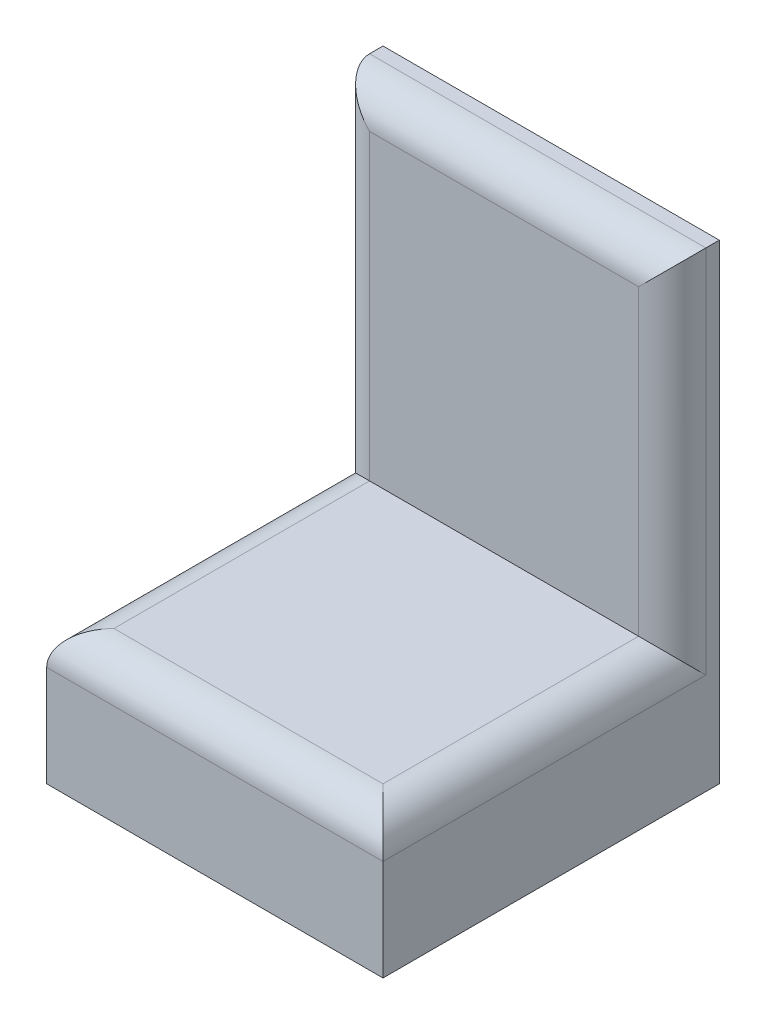
ISO-10303-21;
HEADER;
FILE_DESCRIPTION(('STEP AP214'),'2;1');
FILE_NAME('part.step','',(''),(''),'','','');
FILE_SCHEMA(('AUTOMOTIVE_DESIGN { 1 0 10303 214 1 1 1 1 }'));
ENDSEC;
DATA;
#1=APPLICATION_CONTEXT('core data for automotive mechanical design processes');
#2=APPLICATION_PROTOCOL_DEFINITION('international standard','automotive_design',2000,#1);
#3=PRODUCT_CONTEXT('',#1,'mechanical');
#4=PRODUCT('Part','Part','',(#3));
#5=PRODUCT_RELATED_PRODUCT_CATEGORY('part','',(#4));
#6=PRODUCT_DEFINITION_FORMATION('','',#4);
#7=PRODUCT_DEFINITION_CONTEXT('part definition',#1,'design');
#8=PRODUCT_DEFINITION('design','',#6,#7);
#9=PRODUCT_DEFINITION_SHAPE('','',#8);
#10=(LENGTH_UNIT() NAMED_UNIT(*) SI_UNIT(.MILLI.,.METRE.));
#11=(NAMED_UNIT(*) PLANE_ANGLE_UNIT() SI_UNIT($,.RADIAN.));
#12=(NAMED_UNIT(*) SI_UNIT($,.STERADIAN.) SOLID_ANGLE_UNIT());
#13=UNCERTAINTY_MEASURE_WITH_UNIT(LENGTH_MEASURE(1.E-05),#10,'distance_accuracy_value','');
#14=(GEOMETRIC_REPRESENTATION_CONTEXT(3) GLOBAL_UNCERTAINTY_ASSIGNED_CONTEXT((#13)) GLOBAL_UNIT_ASSIGNED_CONTEXT((#10,
#11,#12)) REPRESENTATION_CONTEXT('',''));
#15=CARTESIAN_POINT('',(0.,0.,0.));
#16=DIRECTION('',(0.,0.,1.));
#17=DIRECTION('',(1.,0.,0.));
#18=AXIS2_PLACEMENT_3D('',#15,#16,#17);
#19=CARTESIAN_POINT('',(500.,41.2352941176501,0.));
#20=DIRECTION('',(0.,0.,1.));
#21=DIRECTION('',(1.,0.,0.));
#22=AXIS2_PLACEMENT_3D('',#19,#20,#21);
#23=PLANE('',#22);
#24=DIRECTION('',(0.,1.,0.));
#25=VECTOR('',#24,1.);
#26=CARTESIAN_POINT('',(0.,41.2352941176501,0.));
#27=LINE('',#26,#25);
#28=CARTESIAN_POINT('',(0.,0.,0.));
#29=VERTEX_POINT('',#28);
#30=CARTESIAN_POINT('',(0.,700.,0.));
#31=VERTEX_POINT('',#30);
#32=EDGE_CURVE('E194',#29,#31,#27,.T.);
#33=ORIENTED_EDGE('',*,*,#32,.T.);
#34=DIRECTION('',(-1.,0.,0.));
#35=VECTOR('',#34,1.);
#36=CARTESIAN_POINT('',(500.,700.,0.));
#37=LINE('',#36,#35);
#38=CARTESIAN_POINT('',(500.,700.,0.));
#39=VERTEX_POINT('',#38);
#40=EDGE_CURVE('E193',#39,#31,#37,.T.);
#41=ORIENTED_EDGE('',*,*,#40,.F.);
#42=DIRECTION('',(0.,1.,0.));
#43=VECTOR('',#42,1.);
#44=CARTESIAN_POINT('',(500.,0.,0.));
#45=LINE('',#44,#43);
#46=CARTESIAN_POINT('',(500.,0.,0.));
#47=VERTEX_POINT('',#46);
#48=EDGE_CURVE('E179',#47,#39,#45,.T.);
#49=ORIENTED_EDGE('',*,*,#48,.F.);
#50=DIRECTION('',(-1.,0.,0.));
#51=VECTOR('',#50,1.);
#52=CARTESIAN_POINT('',(500.,0.,0.));
#53=LINE('',#52,#51);
#54=EDGE_CURVE('E214',#47,#29,#53,.T.);
#55=ORIENTED_EDGE('',*,*,#54,.T.);
#56=EDGE_LOOP('',(#33,#41,#49,#55));
#57=FACE_BOUND('',#56,.T.);
#58=ADVANCED_FACE('F41',(#57),#23,.F.);
#59=CARTESIAN_POINT('',(500.,700.,70.));
#60=DIRECTION('',(0.,-1.,0.));
#61=DIRECTION('',(0.,0.,-1.));
#62=AXIS2_PLACEMENT_3D('',#59,#60,#61);
#63=PLANE('',#62);
#64=DIRECTION('',(0.,0.,1.));
#65=VECTOR('',#64,1.);
#66=CARTESIAN_POINT('',(0.,700.,70.));
#67=LINE('',#66,#65);
#68=CARTESIAN_POINT('',(0.,700.,20.));
#69=VERTEX_POINT('',#68);
#70=EDGE_CURVE('E217',#31,#69,#67,.T.);
#71=ORIENTED_EDGE('',*,*,#70,.T.);
#72=DIRECTION('',(-1.,0.,0.));
#73=VECTOR('',#72,1.);
#74=CARTESIAN_POINT('',(500.,700.,20.));
#75=LINE('',#74,#73);
#76=CARTESIAN_POINT('',(500.,700.,20.));
#77=VERTEX_POINT('',#76);
#78=EDGE_CURVE('E205',#69,#77,#75,.F.);
#79=ORIENTED_EDGE('',*,*,#78,.T.);
#80=DIRECTION('',(0.,0.,1.));
#81=VECTOR('',#80,1.);
#82=CARTESIAN_POINT('',(500.,700.,70.));
#83=LINE('',#82,#81);
#84=EDGE_CURVE('E183',#39,#77,#83,.T.);
#85=ORIENTED_EDGE('',*,*,#84,.F.);
#86=ORIENTED_EDGE('',*,*,#40,.T.);
#87=EDGE_LOOP('',(#71,#79,#85,#86));
#88=FACE_BOUND('',#87,.T.);
#89=ADVANCED_FACE('F203',(#88),#63,.F.);
#90=CARTESIAN_POINT('',(500.,200.,70.));
#91=DIRECTION('',(0.,0.,-1.));
#92=DIRECTION('',(0.,1.,0.));
#93=AXIS2_PLACEMENT_3D('',#90,#91,#92);
#94=PLANE('',#93);
#95=DIRECTION('',(-1.,0.,0.));
#96=VECTOR('',#95,1.);
#97=CARTESIAN_POINT('',(500.,650.,70.));
#98=LINE('',#97,#96);
#99=CARTESIAN_POINT('',(450.,650.,70.));
#100=VERTEX_POINT('',#99);
#101=CARTESIAN_POINT('',(50.,650.,70.));
#102=VERTEX_POINT('',#101);
#103=EDGE_CURVE('E237',#100,#102,#98,.T.);
#104=ORIENTED_EDGE('',*,*,#103,.T.);
#105=DIRECTION('',(0.,-1.,0.));
#106=VECTOR('',#105,1.);
#107=CARTESIAN_POINT('',(50.,200.,70.));
#108=LINE('',#107,#106);
#109=CARTESIAN_POINT('',(50.,200.,70.));
#110=VERTEX_POINT('',#109);
#111=EDGE_CURVE('E241',#102,#110,#108,.T.);
#112=ORIENTED_EDGE('',*,*,#111,.T.);
#113=DIRECTION('',(-1.,0.,0.));
#114=VECTOR('',#113,1.);
#115=CARTESIAN_POINT('',(500.,200.,70.));
#116=LINE('',#115,#114);
#117=CARTESIAN_POINT('',(450.,200.,70.));
#118=VERTEX_POINT('',#117);
#119=EDGE_CURVE('E200',#118,#110,#116,.T.);
#120=ORIENTED_EDGE('',*,*,#119,.F.);
#121=DIRECTION('',(0.,-1.,0.));
#122=VECTOR('',#121,1.);
#123=CARTESIAN_POINT('',(450.,200.,70.));
#124=LINE('',#123,#122);
#125=EDGE_CURVE('E199',#118,#100,#124,.F.);
#126=ORIENTED_EDGE('',*,*,#125,.T.);
#127=EDGE_LOOP('',(#104,#112,#120,#126));
#128=FACE_BOUND('',#127,.T.);
#129=ADVANCED_FACE('F613',(#128),#94,.F.);
#130=CARTESIAN_POINT('',(500.,200.,70.));
#131=DIRECTION('',(0.,-1.,0.));
#132=DIRECTION('',(0.,0.,-1.));
#133=AXIS2_PLACEMENT_3D('',#130,#131,#132);
#134=PLANE('',#133);
#135=ORIENTED_EDGE('',*,*,#119,.T.);
#136=DIRECTION('',(0.,0.,1.));
#137=VECTOR('',#136,1.);
#138=CARTESIAN_POINT('',(50.,200.,500.));
#139=LINE('',#138,#137);
#140=CARTESIAN_POINT('',(50.,200.,450.));
#141=VERTEX_POINT('',#140);
#142=EDGE_CURVE('E124',#110,#141,#139,.T.);
#143=ORIENTED_EDGE('',*,*,#142,.T.);
#144=DIRECTION('',(-1.,0.,0.));
#145=VECTOR('',#144,1.);
#146=CARTESIAN_POINT('',(500.,200.,450.));
#147=LINE('',#146,#145);
#148=CARTESIAN_POINT('',(450.,200.,450.));
#149=VERTEX_POINT('',#148);
#150=EDGE_CURVE('E128',#141,#149,#147,.F.);
#151=ORIENTED_EDGE('',*,*,#150,.T.);
#152=DIRECTION('',(0.,0.,1.));
#153=VECTOR('',#152,1.);
#154=CARTESIAN_POINT('',(450.,200.,70.));
#155=LINE('',#154,#153);
#156=EDGE_CURVE('E258',#149,#118,#155,.F.);
#157=ORIENTED_EDGE('',*,*,#156,.T.);
#158=EDGE_LOOP('',(#135,#143,#151,#157));
#159=FACE_BOUND('',#158,.T.);
#160=ADVANCED_FACE('F603',(#159),#134,.F.);
#161=CARTESIAN_POINT('',(500.,0.,500.));
#162=DIRECTION('',(0.,0.,-1.));
#163=DIRECTION('',(-1.,0.,0.));
#164=AXIS2_PLACEMENT_3D('',#161,#162,#163);
#165=PLANE('',#164);
#166=DIRECTION('',(0.,-1.,0.));
#167=VECTOR('',#166,1.);
#168=CARTESIAN_POINT('',(500.,0.,500.));
#169=LINE('',#168,#167);
#170=CARTESIAN_POINT('',(500.,150.,500.));
#171=VERTEX_POINT('',#170);
#172=CARTESIAN_POINT('',(500.,0.,500.));
#173=VERTEX_POINT('',#172);
#174=EDGE_CURVE('E207',#171,#173,#169,.T.);
#175=ORIENTED_EDGE('',*,*,#174,.F.);
#176=DIRECTION('',(-1.,0.,0.));
#177=VECTOR('',#176,1.);
#178=CARTESIAN_POINT('',(500.,150.,500.));
#179=LINE('',#178,#177);
#180=CARTESIAN_POINT('',(0.,150.,500.));
#181=VERTEX_POINT('',#180);
#182=EDGE_CURVE('E265',#171,#181,#179,.T.);
#183=ORIENTED_EDGE('',*,*,#182,.T.);
#184=DIRECTION('',(0.,-1.,0.));
#185=VECTOR('',#184,1.);
#186=CARTESIAN_POINT('',(0.,0.,500.));
#187=LINE('',#186,#185);
#188=CARTESIAN_POINT('',(0.,0.,500.));
#189=VERTEX_POINT('',#188);
#190=EDGE_CURVE('E221',#181,#189,#187,.T.);
#191=ORIENTED_EDGE('',*,*,#190,.T.);
#192=DIRECTION('',(-1.,0.,0.));
#193=VECTOR('',#192,1.);
#194=CARTESIAN_POINT('',(500.,0.,500.));
#195=LINE('',#194,#193);
#196=EDGE_CURVE('E229',#173,#189,#195,.T.);
#197=ORIENTED_EDGE('',*,*,#196,.F.);
#198=EDGE_LOOP('',(#175,#183,#191,#197));
#199=FACE_BOUND('',#198,.T.);
#200=ADVANCED_FACE('F598',(#199),#165,.F.);
#201=CARTESIAN_POINT('',(500.,0.,0.));
#202=DIRECTION('',(0.,1.,0.));
#203=DIRECTION('',(0.,0.,1.));
#204=AXIS2_PLACEMENT_3D('',#201,#202,#203);
#205=PLANE('',#204);
#206=DIRECTION('',(0.,0.,-1.));
#207=VECTOR('',#206,1.);
#208=CARTESIAN_POINT('',(0.,0.,0.));
#209=LINE('',#208,#207);
#210=EDGE_CURVE('E190',#189,#29,#209,.T.);
#211=ORIENTED_EDGE('',*,*,#210,.T.);
#212=ORIENTED_EDGE('',*,*,#54,.F.);
#213=DIRECTION('',(0.,0.,-1.));
#214=VECTOR('',#213,1.);
#215=CARTESIAN_POINT('',(500.,0.,0.));
#216=LINE('',#215,#214);
#217=EDGE_CURVE('E185',#173,#47,#216,.T.);
#218=ORIENTED_EDGE('',*,*,#217,.F.);
#219=ORIENTED_EDGE('',*,*,#196,.T.);
#220=EDGE_LOOP('',(#211,#212,#218,#219));
#221=FACE_BOUND('',#220,.T.);
#222=ADVANCED_FACE('F591',(#221),#205,.F.);
#223=CARTESIAN_POINT('',(500.,0.,0.));
#224=DIRECTION('',(-1.,0.,0.));
#225=DIRECTION('',(0.,0.,1.));
#226=AXIS2_PLACEMENT_3D('',#223,#224,#225);
#227=PLANE('',#226);
#228=ORIENTED_EDGE('',*,*,#84,.T.);
#229=DIRECTION('',(0.,-1.,0.));
#230=VECTOR('',#229,1.);
#231=CARTESIAN_POINT('',(500.,0.,20.));
#232=LINE('',#231,#230);
#233=CARTESIAN_POINT('',(500.,150.,20.));
#234=VERTEX_POINT('',#233);
#235=EDGE_CURVE('E255',#77,#234,#232,.T.);
#236=ORIENTED_EDGE('',*,*,#235,.T.);
#237=DIRECTION('',(0.,0.,1.));
#238=VECTOR('',#237,1.);
#239=CARTESIAN_POINT('',(500.,150.,0.));
#240=LINE('',#239,#238);
#241=EDGE_CURVE('E252',#234,#171,#240,.T.);
#242=ORIENTED_EDGE('',*,*,#241,.T.);
#243=ORIENTED_EDGE('',*,*,#174,.T.);
#244=ORIENTED_EDGE('',*,*,#217,.T.);
#245=ORIENTED_EDGE('',*,*,#48,.T.);
#246=EDGE_LOOP('',(#228,#236,#242,#243,#244,#245));
#247=FACE_BOUND('',#246,.T.);
#248=ADVANCED_FACE('F181',(#247),#227,.F.);
#249=CARTESIAN_POINT('',(0.,0.,0.));
#250=DIRECTION('',(-1.,0.,0.));
#251=DIRECTION('',(0.,0.,1.));
#252=AXIS2_PLACEMENT_3D('',#249,#250,#251);
#253=PLANE('',#252);
#254=DIRECTION('',(0.,0.,1.));
#255=VECTOR('',#254,1.);
#256=CARTESIAN_POINT('',(0.,150.,70.));
#257=LINE('',#256,#255);
#258=CARTESIAN_POINT('',(0.,150.,20.));
#259=VERTEX_POINT('',#258);
#260=EDGE_CURVE('E246',#181,#259,#257,.F.);
#261=ORIENTED_EDGE('',*,*,#260,.T.);
#262=DIRECTION('',(0.,-1.,0.));
#263=VECTOR('',#262,1.);
#264=CARTESIAN_POINT('',(0.,700.,20.));
#265=LINE('',#264,#263);
#266=EDGE_CURVE('E249',#259,#69,#265,.F.);
#267=ORIENTED_EDGE('',*,*,#266,.T.);
#268=ORIENTED_EDGE('',*,*,#70,.F.);
#269=ORIENTED_EDGE('',*,*,#32,.F.);
#270=ORIENTED_EDGE('',*,*,#210,.F.);
#271=ORIENTED_EDGE('',*,*,#190,.F.);
#272=EDGE_LOOP('',(#261,#267,#268,#269,#270,#271));
#273=FACE_BOUND('',#272,.T.);
#274=ADVANCED_FACE('F573',(#273),#253,.T.);
#275=CARTESIAN_POINT('',(500.,150.,450.));
#276=DIRECTION('',(-1.,0.,0.));
#277=DIRECTION('',(0.,0.,1.));
#278=AXIS2_PLACEMENT_3D('',#275,#276,#277);
#279=CYLINDRICAL_SURFACE('',#278,50.);
#280=CARTESIAN_POINT('',(50.,150.,450.));
#281=DIRECTION('',(-0.707106781186547,0.,-0.707106781186547));
#282=DIRECTION('',(-0.707106781186547,0.,0.707106781186547));
#283=AXIS2_PLACEMENT_3D('',#280,#281,#282);
#284=ELLIPSE('',#283,70.7106781186548,50.);
#285=EDGE_CURVE('E282',#181,#141,#284,.T.);
#286=ORIENTED_EDGE('',*,*,#285,.F.);
#287=ORIENTED_EDGE('',*,*,#182,.F.);
#288=CARTESIAN_POINT('',(450.,150.,450.));
#289=DIRECTION('',(-0.707106781186547,0.,0.707106781186547));
#290=DIRECTION('',(0.707106781186547,0.,0.707106781186547));
#291=AXIS2_PLACEMENT_3D('',#288,#289,#290);
#292=ELLIPSE('',#291,70.7106781186548,50.);
#293=EDGE_CURVE('E218',#149,#171,#292,.F.);
#294=ORIENTED_EDGE('',*,*,#293,.F.);
#295=ORIENTED_EDGE('',*,*,#150,.F.);
#296=EDGE_LOOP('',(#286,#287,#294,#295));
#297=FACE_BOUND('',#296,.T.);
#298=ADVANCED_FACE('F424',(#297),#279,.T.);
#299=CARTESIAN_POINT('',(450.,150.,0.));
#300=DIRECTION('',(0.,0.,1.));
#301=DIRECTION('',(0.,-1.,0.));
#302=AXIS2_PLACEMENT_3D('',#299,#300,#301);
#303=CYLINDRICAL_SURFACE('',#302,50.);
#304=ORIENTED_EDGE('',*,*,#293,.T.);
#305=ORIENTED_EDGE('',*,*,#241,.F.);
#306=CARTESIAN_POINT('',(450.,150.,20.));
#307=DIRECTION('',(0.,-0.707106781186548,0.707106781186547));
#308=DIRECTION('',(0.,-0.707106781186547,-0.707106781186548));
#309=AXIS2_PLACEMENT_3D('',#306,#307,#308);
#310=ELLIPSE('',#309,70.7106781186548,50.);
#311=EDGE_CURVE('E278',#118,#234,#310,.F.);
#312=ORIENTED_EDGE('',*,*,#311,.F.);
#313=ORIENTED_EDGE('',*,*,#156,.F.);
#314=EDGE_LOOP('',(#304,#305,#312,#313));
#315=FACE_BOUND('',#314,.T.);
#316=ADVANCED_FACE('F555',(#315),#303,.T.);
#317=CARTESIAN_POINT('',(50.,150.,70.));
#318=DIRECTION('',(0.,0.,-1.));
#319=DIRECTION('',(0.,1.,0.));
#320=AXIS2_PLACEMENT_3D('',#317,#318,#319);
#321=CYLINDRICAL_SURFACE('',#320,50.);
#322=ORIENTED_EDGE('',*,*,#285,.T.);
#323=ORIENTED_EDGE('',*,*,#142,.F.);
#324=CARTESIAN_POINT('',(50.,150.,20.));
#325=DIRECTION('',(0.,0.707106781186548,-0.707106781186547));
#326=DIRECTION('',(0.,0.707106781186547,0.707106781186548));
#327=AXIS2_PLACEMENT_3D('',#324,#325,#326);
#328=ELLIPSE('',#327,70.7106781186548,50.);
#329=EDGE_CURVE('E274',#259,#110,#328,.T.);
#330=ORIENTED_EDGE('',*,*,#329,.F.);
#331=ORIENTED_EDGE('',*,*,#260,.F.);
#332=EDGE_LOOP('',(#322,#323,#330,#331));
#333=FACE_BOUND('',#332,.T.);
#334=ADVANCED_FACE('F545',(#333),#321,.T.);
#335=CARTESIAN_POINT('',(450.,0.,20.));
#336=DIRECTION('',(0.,-1.,0.));
#337=DIRECTION('',(0.,0.,-1.));
#338=AXIS2_PLACEMENT_3D('',#335,#336,#337);
#339=CYLINDRICAL_SURFACE('',#338,50.);
#340=ORIENTED_EDGE('',*,*,#311,.T.);
#341=ORIENTED_EDGE('',*,*,#235,.F.);
#342=CARTESIAN_POINT('',(450.,650.,20.));
#343=DIRECTION('',(0.707106781186547,-0.707106781186547,0.));
#344=DIRECTION('',(-0.707106781186547,-0.707106781186547,0.));
#345=AXIS2_PLACEMENT_3D('',#342,#343,#344);
#346=ELLIPSE('',#345,70.7106781186548,50.);
#347=EDGE_CURVE('E271',#100,#77,#346,.F.);
#348=ORIENTED_EDGE('',*,*,#347,.F.);
#349=ORIENTED_EDGE('',*,*,#125,.F.);
#350=EDGE_LOOP('',(#340,#341,#348,#349));
#351=FACE_BOUND('',#350,.T.);
#352=ADVANCED_FACE('F535',(#351),#339,.T.);
#353=CARTESIAN_POINT('',(50.,200.,20.));
#354=DIRECTION('',(0.,1.,0.));
#355=DIRECTION('',(0.,0.,1.));
#356=AXIS2_PLACEMENT_3D('',#353,#354,#355);
#357=CYLINDRICAL_SURFACE('',#356,50.);
#358=ORIENTED_EDGE('',*,*,#329,.T.);
#359=ORIENTED_EDGE('',*,*,#111,.F.);
#360=CARTESIAN_POINT('',(50.,650.,20.));
#361=DIRECTION('',(0.707106781186547,0.707106781186547,0.));
#362=DIRECTION('',(-0.707106781186547,0.707106781186547,0.));
#363=AXIS2_PLACEMENT_3D('',#360,#361,#362);
#364=ELLIPSE('',#363,70.7106781186548,50.);
#365=EDGE_CURVE('E268',#69,#102,#364,.T.);
#366=ORIENTED_EDGE('',*,*,#365,.F.);
#367=ORIENTED_EDGE('',*,*,#266,.F.);
#368=EDGE_LOOP('',(#358,#359,#366,#367));
#369=FACE_BOUND('',#368,.T.);
#370=ADVANCED_FACE('F525',(#369),#357,.T.);
#371=CARTESIAN_POINT('',(500.,650.,20.));
#372=DIRECTION('',(-1.,0.,0.));
#373=DIRECTION('',(0.,0.,1.));
#374=AXIS2_PLACEMENT_3D('',#371,#372,#373);
#375=CYLINDRICAL_SURFACE('',#374,50.);
#376=ORIENTED_EDGE('',*,*,#347,.T.);
#377=ORIENTED_EDGE('',*,*,#78,.F.);
#378=ORIENTED_EDGE('',*,*,#365,.T.);
#379=ORIENTED_EDGE('',*,*,#103,.F.);
#380=EDGE_LOOP('',(#376,#377,#378,#379));
#381=FACE_BOUND('',#380,.T.);
#382=ADVANCED_FACE('F522',(#381),#375,.T.);
#383=CLOSED_SHELL('',(#58,#89,#129,#160,#200,#222,#248,#274,#298,#316,#334,#352,#370,#382));
#384=CARTESIAN_POINT('',(500.,41.2352941176501,25.4));
#385=DIRECTION('',(0.,0.,1.));
#386=DIRECTION('',(1.,0.,0.));
#387=AXIS2_PLACEMENT_3D('',#384,#385,#386);
#388=PLANE('',#387);
#389=DIRECTION('',(-1.,0.,0.));
#390=VECTOR('',#389,1.);
#391=CARTESIAN_POINT('',(500.,674.,25.4));
#392=LINE('',#391,#390);
#393=CARTESIAN_POINT('',(474.,674.,25.4));
#394=VERTEX_POINT('',#393);
#395=CARTESIAN_POINT('',(26.,674.,25.4));
#396=VERTEX_POINT('',#395);
#397=EDGE_CURVE('E53',#394,#396,#392,.T.);
#398=ORIENTED_EDGE('',*,*,#397,.T.);
#399=DIRECTION('',(0.,1.,0.));
#400=VECTOR('',#399,1.);
#401=CARTESIAN_POINT('',(26.,200.,25.4));
#402=LINE('',#401,#400);
#403=CARTESIAN_POINT('',(26.,155.4,25.4));
#404=VERTEX_POINT('',#403);
#405=EDGE_CURVE('E298',#396,#404,#402,.F.);
#406=ORIENTED_EDGE('',*,*,#405,.T.);
#407=CARTESIAN_POINT('',(50.,150.,25.4));
#408=DIRECTION('',(0.,0.,1.));
#409=DIRECTION('',(1.,0.,0.));
#410=AXIS2_PLACEMENT_3D('',#407,#408,#409);
#411=CIRCLE('',#410,24.6);
#412=CARTESIAN_POINT('',(25.4,150.,25.4));
#413=VERTEX_POINT('',#412);
#414=EDGE_CURVE('E312',#404,#413,#411,.T.);
#415=ORIENTED_EDGE('',*,*,#414,.T.);
#416=DIRECTION('',(0.,1.,0.));
#417=VECTOR('',#416,1.);
#418=CARTESIAN_POINT('',(25.4,0.,25.4));
#419=LINE('',#418,#417);
#420=CARTESIAN_POINT('',(25.4,25.4,25.4));
#421=VERTEX_POINT('',#420);
#422=EDGE_CURVE('E373',#421,#413,#419,.T.);
#423=ORIENTED_EDGE('',*,*,#422,.F.);
#424=DIRECTION('',(-1.,0.,0.));
#425=VECTOR('',#424,1.);
#426=CARTESIAN_POINT('',(500.,25.4,25.4));
#427=LINE('',#426,#425);
#428=CARTESIAN_POINT('',(474.6,25.4,25.4));
#429=VERTEX_POINT('',#428);
#430=EDGE_CURVE('E376',#429,#421,#427,.T.);
#431=ORIENTED_EDGE('',*,*,#430,.F.);
#432=DIRECTION('',(0.,1.,0.));
#433=VECTOR('',#432,1.);
#434=CARTESIAN_POINT('',(474.6,0.,25.4));
#435=LINE('',#434,#433);
#436=CARTESIAN_POINT('',(474.6,150.,25.4));
#437=VERTEX_POINT('',#436);
#438=EDGE_CURVE('E332',#429,#437,#435,.T.);
#439=ORIENTED_EDGE('',*,*,#438,.T.);
#440=CARTESIAN_POINT('',(450.,150.,25.4));
#441=DIRECTION('',(0.,0.,1.));
#442=DIRECTION('',(1.,0.,0.));
#443=AXIS2_PLACEMENT_3D('',#440,#441,#442);
#444=CIRCLE('',#443,24.6);
#445=CARTESIAN_POINT('',(474.,155.4,25.4));
#446=VERTEX_POINT('',#445);
#447=EDGE_CURVE('E45',#446,#437,#444,.F.);
#448=ORIENTED_EDGE('',*,*,#447,.F.);
#449=DIRECTION('',(0.,-1.,0.));
#450=VECTOR('',#449,1.);
#451=CARTESIAN_POINT('',(474.,0.,25.4));
#452=LINE('',#451,#450);
#453=EDGE_CURVE('E302',#446,#394,#452,.F.);
#454=ORIENTED_EDGE('',*,*,#453,.T.);
#455=EDGE_LOOP('',(#398,#406,#415,#423,#431,#439,#448,#454));
#456=FACE_BOUND('',#455,.T.);
#457=ADVANCED_FACE('F388',(#456),#388,.T.);
#458=CARTESIAN_POINT('',(500.,200.,44.6));
#459=DIRECTION('',(0.,0.,-1.));
#460=DIRECTION('',(0.,1.,0.));
#461=AXIS2_PLACEMENT_3D('',#458,#459,#460);
#462=PLANE('',#461);
#463=DIRECTION('',(1.,0.,0.));
#464=VECTOR('',#463,1.);
#465=CARTESIAN_POINT('',(500.,650.,44.6));
#466=LINE('',#465,#464);
#467=CARTESIAN_POINT('',(450.,650.,44.6));
#468=VERTEX_POINT('',#467);
#469=CARTESIAN_POINT('',(50.,650.,44.6));
#470=VERTEX_POINT('',#469);
#471=EDGE_CURVE('E369',#468,#470,#466,.F.);
#472=ORIENTED_EDGE('',*,*,#471,.F.);
#473=DIRECTION('',(0.,1.,0.));
#474=VECTOR('',#473,1.);
#475=CARTESIAN_POINT('',(450.,200.,44.6));
#476=LINE('',#475,#474);
#477=CARTESIAN_POINT('',(450.,174.6,44.6));
#478=VERTEX_POINT('',#477);
#479=EDGE_CURVE('E363',#478,#468,#476,.T.);
#480=ORIENTED_EDGE('',*,*,#479,.F.);
#481=DIRECTION('',(-1.,0.,0.));
#482=VECTOR('',#481,1.);
#483=CARTESIAN_POINT('',(500.,174.6,44.6));
#484=LINE('',#483,#482);
#485=CARTESIAN_POINT('',(50.,174.6,44.6));
#486=VERTEX_POINT('',#485);
#487=EDGE_CURVE('E359',#478,#486,#484,.T.);
#488=ORIENTED_EDGE('',*,*,#487,.T.);
#489=DIRECTION('',(0.,1.,0.));
#490=VECTOR('',#489,1.);
#491=CARTESIAN_POINT('',(50.,200.,44.6));
#492=LINE('',#491,#490);
#493=EDGE_CURVE('E366',#470,#486,#492,.F.);
#494=ORIENTED_EDGE('',*,*,#493,.F.);
#495=EDGE_LOOP('',(#472,#480,#488,#494));
#496=FACE_BOUND('',#495,.T.);
#497=ADVANCED_FACE('F409',(#496),#462,.T.);
#498=CARTESIAN_POINT('',(500.,174.6,70.));
#499=DIRECTION('',(0.,-1.,0.));
#500=DIRECTION('',(0.,0.,-1.));
#501=AXIS2_PLACEMENT_3D('',#498,#499,#500);
#502=PLANE('',#501);
#503=ORIENTED_EDGE('',*,*,#487,.F.);
#504=DIRECTION('',(0.,0.,-1.));
#505=VECTOR('',#504,1.);
#506=CARTESIAN_POINT('',(450.,174.6,70.));
#507=LINE('',#506,#505);
#508=CARTESIAN_POINT('',(450.,174.6,450.));
#509=VERTEX_POINT('',#508);
#510=EDGE_CURVE('E350',#509,#478,#507,.T.);
#511=ORIENTED_EDGE('',*,*,#510,.F.);
#512=DIRECTION('',(1.,0.,0.));
#513=VECTOR('',#512,1.);
#514=CARTESIAN_POINT('',(500.,174.6,450.));
#515=LINE('',#514,#513);
#516=CARTESIAN_POINT('',(50.,174.6,450.));
#517=VERTEX_POINT('',#516);
#518=EDGE_CURVE('E353',#517,#509,#515,.T.);
#519=ORIENTED_EDGE('',*,*,#518,.F.);
#520=DIRECTION('',(0.,0.,-1.));
#521=VECTOR('',#520,1.);
#522=CARTESIAN_POINT('',(50.,174.6,70.));
#523=LINE('',#522,#521);
#524=EDGE_CURVE('E356',#486,#517,#523,.F.);
#525=ORIENTED_EDGE('',*,*,#524,.F.);
#526=EDGE_LOOP('',(#503,#511,#519,#525));
#527=FACE_BOUND('',#526,.T.);
#528=ADVANCED_FACE('F400',(#527),#502,.T.);
#529=CARTESIAN_POINT('',(500.,0.,474.6));
#530=DIRECTION('',(0.,0.,-1.));
#531=DIRECTION('',(-1.,0.,0.));
#532=AXIS2_PLACEMENT_3D('',#529,#530,#531);
#533=PLANE('',#532);
#534=DIRECTION('',(0.,-1.,0.));
#535=VECTOR('',#534,1.);
#536=CARTESIAN_POINT('',(474.6,0.,474.6));
#537=LINE('',#536,#535);
#538=CARTESIAN_POINT('',(474.6,150.,474.6));
#539=VERTEX_POINT('',#538);
#540=CARTESIAN_POINT('',(474.6,25.3999999999999,474.6));
#541=VERTEX_POINT('',#540);
#542=EDGE_CURVE('E326',#539,#541,#537,.T.);
#543=ORIENTED_EDGE('',*,*,#542,.T.);
#544=DIRECTION('',(-1.,0.,0.));
#545=VECTOR('',#544,1.);
#546=CARTESIAN_POINT('',(500.,25.3999999999999,474.6));
#547=LINE('',#546,#545);
#548=CARTESIAN_POINT('',(25.4,25.3999999999999,474.6));
#549=VERTEX_POINT('',#548);
#550=EDGE_CURVE('E336',#541,#549,#547,.T.);
#551=ORIENTED_EDGE('',*,*,#550,.T.);
#552=DIRECTION('',(0.,-1.,0.));
#553=VECTOR('',#552,1.);
#554=CARTESIAN_POINT('',(25.4,0.,474.6));
#555=LINE('',#554,#553);
#556=CARTESIAN_POINT('',(25.4,150.,474.6));
#557=VERTEX_POINT('',#556);
#558=EDGE_CURVE('E344',#557,#549,#555,.T.);
#559=ORIENTED_EDGE('',*,*,#558,.F.);
#560=DIRECTION('',(-1.,0.,0.));
#561=VECTOR('',#560,1.);
#562=CARTESIAN_POINT('',(500.,150.,474.6));
#563=LINE('',#562,#561);
#564=EDGE_CURVE('E347',#539,#557,#563,.T.);
#565=ORIENTED_EDGE('',*,*,#564,.F.);
#566=EDGE_LOOP('',(#543,#551,#559,#565));
#567=FACE_BOUND('',#566,.T.);
#568=ADVANCED_FACE('F429',(#567),#533,.T.);
#569=CARTESIAN_POINT('',(500.,25.4,0.));
#570=DIRECTION('',(0.,1.,0.));
#571=DIRECTION('',(0.,0.,1.));
#572=AXIS2_PLACEMENT_3D('',#569,#570,#571);
#573=PLANE('',#572);
#574=DIRECTION('',(0.,0.,-1.));
#575=VECTOR('',#574,1.);
#576=CARTESIAN_POINT('',(25.4,25.4,0.));
#577=LINE('',#576,#575);
#578=EDGE_CURVE('E340',#549,#421,#577,.T.);
#579=ORIENTED_EDGE('',*,*,#578,.F.);
#580=ORIENTED_EDGE('',*,*,#550,.F.);
#581=DIRECTION('',(0.,0.,-1.));
#582=VECTOR('',#581,1.);
#583=CARTESIAN_POINT('',(474.6,25.4,0.));
#584=LINE('',#583,#582);
#585=EDGE_CURVE('E323',#541,#429,#584,.T.);
#586=ORIENTED_EDGE('',*,*,#585,.T.);
#587=ORIENTED_EDGE('',*,*,#430,.T.);
#588=EDGE_LOOP('',(#579,#580,#586,#587));
#589=FACE_BOUND('',#588,.T.);
#590=ADVANCED_FACE('F383',(#589),#573,.T.);
#591=CARTESIAN_POINT('',(474.6,0.,0.));
#592=DIRECTION('',(-1.,0.,0.));
#593=DIRECTION('',(0.,0.,1.));
#594=AXIS2_PLACEMENT_3D('',#591,#592,#593);
#595=PLANE('',#594);
#596=ORIENTED_EDGE('',*,*,#438,.F.);
#597=ORIENTED_EDGE('',*,*,#585,.F.);
#598=ORIENTED_EDGE('',*,*,#542,.F.);
#599=DIRECTION('',(0.,0.,1.));
#600=VECTOR('',#599,1.);
#601=CARTESIAN_POINT('',(474.6,150.,0.));
#602=LINE('',#601,#600);
#603=EDGE_CURVE('E329',#437,#539,#602,.T.);
#604=ORIENTED_EDGE('',*,*,#603,.F.);
#605=EDGE_LOOP('',(#596,#597,#598,#604));
#606=FACE_BOUND('',#605,.T.);
#607=ADVANCED_FACE('F390',(#606),#595,.T.);
#608=CARTESIAN_POINT('',(25.4,0.,0.));
#609=DIRECTION('',(-1.,0.,0.));
#610=DIRECTION('',(0.,0.,1.));
#611=AXIS2_PLACEMENT_3D('',#608,#609,#610);
#612=PLANE('',#611);
#613=DIRECTION('',(0.,0.,1.));
#614=VECTOR('',#613,1.);
#615=CARTESIAN_POINT('',(25.4,150.,0.));
#616=LINE('',#615,#614);
#617=EDGE_CURVE('E319',#557,#413,#616,.F.);
#618=ORIENTED_EDGE('',*,*,#617,.F.);
#619=ORIENTED_EDGE('',*,*,#558,.T.);
#620=ORIENTED_EDGE('',*,*,#578,.T.);
#621=ORIENTED_EDGE('',*,*,#422,.T.);
#622=EDGE_LOOP('',(#618,#619,#620,#621));
#623=FACE_BOUND('',#622,.T.);
#624=ADVANCED_FACE('F437',(#623),#612,.F.);
#625=CARTESIAN_POINT('',(500.,150.,450.));
#626=DIRECTION('',(-1.,0.,0.));
#627=DIRECTION('',(0.,0.,1.));
#628=AXIS2_PLACEMENT_3D('',#625,#626,#627);
#629=CYLINDRICAL_SURFACE('',#628,24.6);
#630=CARTESIAN_POINT('',(50.,150.,450.));
#631=DIRECTION('',(-0.707106781186547,0.,-0.707106781186547));
#632=DIRECTION('',(0.707106781186547,0.,-0.707106781186547));
#633=AXIS2_PLACEMENT_3D('',#630,#631,#632);
#634=ELLIPSE('',#633,34.7896536343781,24.6);
#635=EDGE_CURVE('E308',#557,#517,#634,.T.);
#636=ORIENTED_EDGE('',*,*,#635,.T.);
#637=ORIENTED_EDGE('',*,*,#518,.T.);
#638=CARTESIAN_POINT('',(450.,150.,450.));
#639=DIRECTION('',(-0.707106781186547,0.,0.707106781186547));
#640=DIRECTION('',(0.707106781186547,0.,0.707106781186547));
#641=AXIS2_PLACEMENT_3D('',#638,#639,#640);
#642=ELLIPSE('',#641,34.7896536343781,24.6);
#643=EDGE_CURVE('E315',#509,#539,#642,.F.);
#644=ORIENTED_EDGE('',*,*,#643,.T.);
#645=ORIENTED_EDGE('',*,*,#564,.T.);
#646=EDGE_LOOP('',(#636,#637,#644,#645));
#647=FACE_BOUND('',#646,.T.);
#648=ADVANCED_FACE('F440',(#647),#629,.F.);
#649=CARTESIAN_POINT('',(450.,150.,0.));
#650=DIRECTION('',(0.,0.,1.));
#651=DIRECTION('',(0.,-1.,0.));
#652=AXIS2_PLACEMENT_3D('',#649,#650,#651);
#653=CYLINDRICAL_SURFACE('',#652,24.6);
#654=ORIENTED_EDGE('',*,*,#447,.T.);
#655=ORIENTED_EDGE('',*,*,#603,.T.);
#656=ORIENTED_EDGE('',*,*,#643,.F.);
#657=ORIENTED_EDGE('',*,*,#510,.T.);
#658=CARTESIAN_POINT('',(450.,150.,20.));
#659=DIRECTION('',(0.,-0.707106781186548,0.707106781186547));
#660=DIRECTION('',(0.,0.707106781186547,0.707106781186548));
#661=AXIS2_PLACEMENT_3D('',#658,#659,#660);
#662=ELLIPSE('',#661,34.7896536343781,24.6);
#663=EDGE_CURVE('E305',#478,#446,#662,.F.);
#664=ORIENTED_EDGE('',*,*,#663,.T.);
#665=EDGE_LOOP('',(#654,#655,#656,#657,#664));
#666=FACE_BOUND('',#665,.T.);
#667=ADVANCED_FACE('F394',(#666),#653,.F.);
#668=CARTESIAN_POINT('',(50.,150.,70.));
#669=DIRECTION('',(0.,0.,-1.));
#670=DIRECTION('',(0.,1.,0.));
#671=AXIS2_PLACEMENT_3D('',#668,#669,#670);
#672=CYLINDRICAL_SURFACE('',#671,24.6);
#673=CARTESIAN_POINT('',(50.,150.,20.));
#674=DIRECTION('',(0.,0.707106781186548,-0.707106781186547));
#675=DIRECTION('',(0.,-0.707106781186547,-0.707106781186548));
#676=AXIS2_PLACEMENT_3D('',#673,#674,#675);
#677=ELLIPSE('',#676,34.7896536343781,24.6);
#678=EDGE_CURVE('E295',#404,#486,#677,.T.);
#679=ORIENTED_EDGE('',*,*,#678,.T.);
#680=ORIENTED_EDGE('',*,*,#524,.T.);
#681=ORIENTED_EDGE('',*,*,#635,.F.);
#682=ORIENTED_EDGE('',*,*,#617,.T.);
#683=ORIENTED_EDGE('',*,*,#414,.F.);
#684=EDGE_LOOP('',(#679,#680,#681,#682,#683));
#685=FACE_BOUND('',#684,.T.);
#686=ADVANCED_FACE('F446',(#685),#672,.F.);
#687=CARTESIAN_POINT('',(450.,0.,20.));
#688=DIRECTION('',(0.,-1.,0.));
#689=DIRECTION('',(0.,0.,-1.));
#690=AXIS2_PLACEMENT_3D('',#687,#688,#689);
#691=CYLINDRICAL_SURFACE('',#690,24.6);
#692=ORIENTED_EDGE('',*,*,#663,.F.);
#693=ORIENTED_EDGE('',*,*,#479,.T.);
#694=CARTESIAN_POINT('',(450.,650.,20.));
#695=DIRECTION('',(-0.707106781186547,0.707106781186547,0.));
#696=DIRECTION('',(-0.707106781186547,-0.707106781186547,0.));
#697=AXIS2_PLACEMENT_3D('',#694,#695,#696);
#698=ELLIPSE('',#697,34.7896536343781,24.6);
#699=EDGE_CURVE('E291',#468,#394,#698,.T.);
#700=ORIENTED_EDGE('',*,*,#699,.T.);
#701=ORIENTED_EDGE('',*,*,#453,.F.);
#702=EDGE_LOOP('',(#692,#693,#700,#701));
#703=FACE_BOUND('',#702,.T.);
#704=ADVANCED_FACE('F407',(#703),#691,.F.);
#705=CARTESIAN_POINT('',(50.,200.,20.));
#706=DIRECTION('',(0.,1.,0.));
#707=DIRECTION('',(0.,0.,1.));
#708=AXIS2_PLACEMENT_3D('',#705,#706,#707);
#709=CYLINDRICAL_SURFACE('',#708,24.6);
#710=CARTESIAN_POINT('',(50.,650.,20.));
#711=DIRECTION('',(-0.707106781186547,-0.707106781186547,0.));
#712=DIRECTION('',(-0.707106781186547,0.707106781186547,0.));
#713=AXIS2_PLACEMENT_3D('',#710,#711,#712);
#714=ELLIPSE('',#713,34.7896536343781,24.6);
#715=EDGE_CURVE('E11',#396,#470,#714,.F.);
#716=ORIENTED_EDGE('',*,*,#715,.T.);
#717=ORIENTED_EDGE('',*,*,#493,.T.);
#718=ORIENTED_EDGE('',*,*,#678,.F.);
#719=ORIENTED_EDGE('',*,*,#405,.F.);
#720=EDGE_LOOP('',(#716,#717,#718,#719));
#721=FACE_BOUND('',#720,.T.);
#722=ADVANCED_FACE('F411',(#721),#709,.F.);
#723=CARTESIAN_POINT('',(500.,650.,20.));
#724=DIRECTION('',(-1.,0.,0.));
#725=DIRECTION('',(0.,0.,1.));
#726=AXIS2_PLACEMENT_3D('',#723,#724,#725);
#727=CYLINDRICAL_SURFACE('',#726,24.6);
#728=ORIENTED_EDGE('',*,*,#699,.F.);
#729=ORIENTED_EDGE('',*,*,#471,.T.);
#730=ORIENTED_EDGE('',*,*,#715,.F.);
#731=ORIENTED_EDGE('',*,*,#397,.F.);
#732=EDGE_LOOP('',(#728,#729,#730,#731));
#733=FACE_BOUND('',#732,.T.);
#734=ADVANCED_FACE('F43',(#733),#727,.F.);
#735=CLOSED_SHELL('',(#457,#497,#528,#568,#590,#607,#624,#648,#667,#686,#704,#722,#734));
#736=ORIENTED_CLOSED_SHELL('',*,#735,.T.);
#737=BREP_WITH_VOIDS('B2',#383,(#736));
#738=ADVANCED_BREP_SHAPE_REPRESENTATION('',(#18,#737),#14);
#739=SHAPE_DEFINITION_REPRESENTATION(#9,#738);
ENDSEC;
END-ISO-10303-21;
